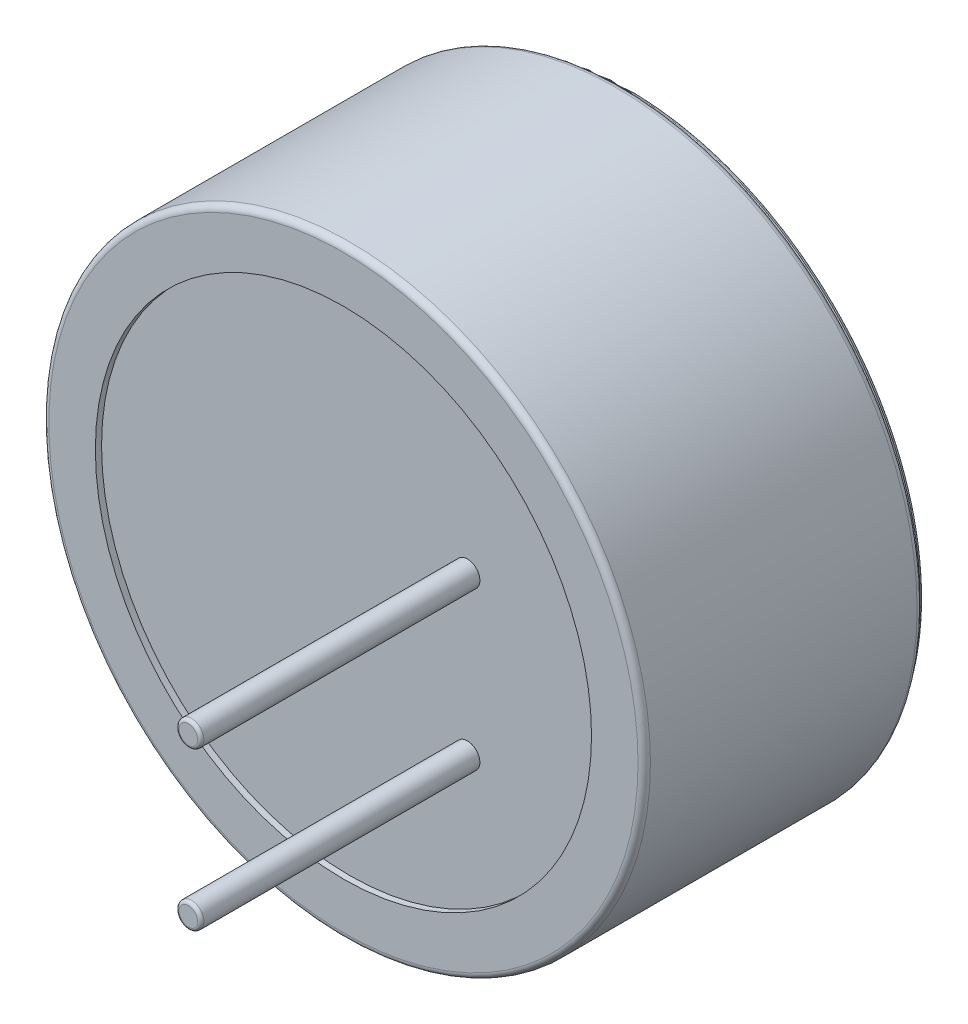
ISO-10303-21;
HEADER;
FILE_DESCRIPTION(('STEP AP214'),'2;1');
FILE_NAME('part.step','',(''),(''),'','','');
FILE_SCHEMA(('AUTOMOTIVE_DESIGN { 1 0 10303 214 1 1 1 1 }'));
ENDSEC;
DATA;
#1=APPLICATION_CONTEXT('core data for automotive mechanical design processes');
#2=APPLICATION_PROTOCOL_DEFINITION('international standard','automotive_design',2000,#1);
#3=PRODUCT_CONTEXT('',#1,'mechanical');
#4=PRODUCT('Part','Part','',(#3));
#5=PRODUCT_RELATED_PRODUCT_CATEGORY('part','',(#4));
#6=PRODUCT_DEFINITION_FORMATION('','',#4);
#7=PRODUCT_DEFINITION_CONTEXT('part definition',#1,'design');
#8=PRODUCT_DEFINITION('design','',#6,#7);
#9=PRODUCT_DEFINITION_SHAPE('','',#8);
#10=(LENGTH_UNIT() NAMED_UNIT(*) SI_UNIT(.MILLI.,.METRE.));
#11=(NAMED_UNIT(*) PLANE_ANGLE_UNIT() SI_UNIT($,.RADIAN.));
#12=(NAMED_UNIT(*) SI_UNIT($,.STERADIAN.) SOLID_ANGLE_UNIT());
#13=UNCERTAINTY_MEASURE_WITH_UNIT(LENGTH_MEASURE(1.E-05),#10,'distance_accuracy_value','');
#14=(GEOMETRIC_REPRESENTATION_CONTEXT(3) GLOBAL_UNCERTAINTY_ASSIGNED_CONTEXT((#13)) GLOBAL_UNIT_ASSIGNED_CONTEXT((#10,
#11,#12)) REPRESENTATION_CONTEXT('',''));
#15=CARTESIAN_POINT('',(0.,0.,0.));
#16=DIRECTION('',(0.,0.,1.));
#17=DIRECTION('',(1.,0.,0.));
#18=AXIS2_PLACEMENT_3D('',#15,#16,#17);
#19=CARTESIAN_POINT('',(0.,0.,-0.1));
#20=DIRECTION('',(0.,0.,1.));
#21=DIRECTION('',(1.,0.,0.));
#22=AXIS2_PLACEMENT_3D('',#19,#20,#21);
#23=CYLINDRICAL_SURFACE('',#22,4.75);
#24=CARTESIAN_POINT('',(0.,0.,-0.05));
#25=DIRECTION('',(0.,0.,-1.));
#26=DIRECTION('',(-1.,0.,0.));
#27=AXIS2_PLACEMENT_3D('',#24,#25,#26);
#28=CIRCLE('',#27,4.75);
#29=CARTESIAN_POINT('',(-4.75,0.,-0.05));
#30=VERTEX_POINT('',#29);
#31=EDGE_CURVE('E11',#30,#30,#28,.F.);
#32=ORIENTED_EDGE('',*,*,#31,.T.);
#33=EDGE_LOOP('',(#32));
#34=FACE_BOUND('',#33,.T.);
#35=CARTESIAN_POINT('',(0.,0.,0.));
#36=DIRECTION('',(0.,0.,-1.));
#37=DIRECTION('',(-1.,0.,0.));
#38=AXIS2_PLACEMENT_3D('',#35,#36,#37);
#39=CIRCLE('',#38,4.75);
#40=CARTESIAN_POINT('',(-4.75,0.,0.));
#41=VERTEX_POINT('',#40);
#42=EDGE_CURVE('E53',#41,#41,#39,.T.);
#43=ORIENTED_EDGE('',*,*,#42,.T.);
#44=EDGE_LOOP('',(#43));
#45=FACE_BOUND('',#44,.T.);
#46=ADVANCED_FACE('F42',(#34,#45),#23,.T.);
#47=CARTESIAN_POINT('',(0.,0.,-0.1));
#48=DIRECTION('',(0.,0.,-1.));
#49=DIRECTION('',(-1.,0.,0.));
#50=AXIS2_PLACEMENT_3D('',#47,#48,#49);
#51=PLANE('',#50);
#52=CARTESIAN_POINT('',(0.,0.,-0.1));
#53=DIRECTION('',(0.,0.,-1.));
#54=DIRECTION('',(-1.,0.,0.));
#55=AXIS2_PLACEMENT_3D('',#52,#53,#54);
#56=CIRCLE('',#55,4.7);
#57=CARTESIAN_POINT('',(-4.7,0.,-0.1));
#58=VERTEX_POINT('',#57);
#59=EDGE_CURVE('E49',#58,#58,#56,.T.);
#60=ORIENTED_EDGE('',*,*,#59,.T.);
#61=EDGE_LOOP('',(#60));
#62=FACE_BOUND('',#61,.T.);
#63=ADVANCED_FACE('F63',(#62),#51,.T.);
#64=CARTESIAN_POINT('',(0.,0.,0.));
#65=DIRECTION('',(0.,0.,-1.));
#66=DIRECTION('',(-1.,0.,0.));
#67=AXIS2_PLACEMENT_3D('',#64,#65,#66);
#68=PLANE('',#67);
#69=ORIENTED_EDGE('',*,*,#42,.F.);
#70=EDGE_LOOP('',(#69));
#71=FACE_BOUND('',#70,.T.);
#72=ADVANCED_FACE('F61',(#71),#68,.F.);
#73=CARTESIAN_POINT('',(0.,0.,-0.05));
#74=DIRECTION('',(0.,0.,-1.));
#75=DIRECTION('',(-1.,0.,0.));
#76=AXIS2_PLACEMENT_3D('',#73,#74,#75);
#77=TOROIDAL_SURFACE('',#76,4.7,0.05);
#78=ORIENTED_EDGE('',*,*,#31,.F.);
#79=EDGE_LOOP('',(#78));
#80=FACE_BOUND('',#79,.T.);
#81=ORIENTED_EDGE('',*,*,#59,.F.);
#82=EDGE_LOOP('',(#81));
#83=FACE_BOUND('',#82,.T.);
#84=ADVANCED_FACE('F44',(#80,#83),#77,.T.);
#85=CLOSED_SHELL('',(#46,#63,#72,#84));
#86=MANIFOLD_SOLID_BREP('B2',#85);
#87=CARTESIAN_POINT('',(2.,1.27,9.));
#88=DIRECTION('',(0.,0.,-1.));
#89=DIRECTION('',(-1.,0.,0.));
#90=AXIS2_PLACEMENT_3D('',#87,#88,#89);
#91=CYLINDRICAL_SURFACE('',#90,0.2);
#92=CARTESIAN_POINT('',(2.,1.27,8.95));
#93=DIRECTION('',(0.,0.,-1.));
#94=DIRECTION('',(-1.,0.,0.));
#95=AXIS2_PLACEMENT_3D('',#92,#93,#94);
#96=CIRCLE('',#95,0.2);
#97=CARTESIAN_POINT('',(1.8,1.27,8.95));
#98=VERTEX_POINT('',#97);
#99=EDGE_CURVE('E41',#98,#98,#96,.T.);
#100=ORIENTED_EDGE('',*,*,#99,.T.);
#101=EDGE_LOOP('',(#100));
#102=FACE_BOUND('',#101,.T.);
#103=CARTESIAN_POINT('',(2.,1.27,4.5));
#104=DIRECTION('',(0.,0.,1.));
#105=DIRECTION('',(-1.,0.,0.));
#106=AXIS2_PLACEMENT_3D('',#103,#104,#105);
#107=CIRCLE('',#106,0.2);
#108=CARTESIAN_POINT('',(1.8,1.27,4.5));
#109=VERTEX_POINT('',#108);
#110=EDGE_CURVE('E117',#109,#109,#107,.T.);
#111=ORIENTED_EDGE('',*,*,#110,.T.);
#112=EDGE_LOOP('',(#111));
#113=FACE_BOUND('',#112,.T.);
#114=ADVANCED_FACE('F106',(#102,#113),#91,.T.);
#115=CARTESIAN_POINT('',(2.,1.27,9.));
#116=DIRECTION('',(0.,0.,-1.));
#117=DIRECTION('',(-1.,0.,0.));
#118=AXIS2_PLACEMENT_3D('',#115,#116,#117);
#119=PLANE('',#118);
#120=CARTESIAN_POINT('',(2.,1.27,9.));
#121=DIRECTION('',(0.,0.,-1.));
#122=DIRECTION('',(-1.,0.,0.));
#123=AXIS2_PLACEMENT_3D('',#120,#121,#122);
#124=CIRCLE('',#123,0.15);
#125=CARTESIAN_POINT('',(1.85,1.27,9.));
#126=VERTEX_POINT('',#125);
#127=EDGE_CURVE('E113',#126,#126,#124,.F.);
#128=ORIENTED_EDGE('',*,*,#127,.T.);
#129=EDGE_LOOP('',(#128));
#130=FACE_BOUND('',#129,.T.);
#131=ADVANCED_FACE('F127',(#130),#119,.F.);
#132=CARTESIAN_POINT('',(2.,1.27,4.5));
#133=DIRECTION('',(0.,0.,-1.));
#134=DIRECTION('',(-1.,0.,0.));
#135=AXIS2_PLACEMENT_3D('',#132,#133,#134);
#136=PLANE('',#135);
#137=ORIENTED_EDGE('',*,*,#110,.F.);
#138=EDGE_LOOP('',(#137));
#139=FACE_BOUND('',#138,.T.);
#140=ADVANCED_FACE('F125',(#139),#136,.T.);
#141=CARTESIAN_POINT('',(2.,1.27,8.95));
#142=DIRECTION('',(0.,0.,-1.));
#143=DIRECTION('',(-1.,0.,0.));
#144=AXIS2_PLACEMENT_3D('',#141,#142,#143);
#145=TOROIDAL_SURFACE('',#144,0.15,0.05);
#146=ORIENTED_EDGE('',*,*,#99,.F.);
#147=EDGE_LOOP('',(#146));
#148=FACE_BOUND('',#147,.T.);
#149=ORIENTED_EDGE('',*,*,#127,.F.);
#150=EDGE_LOOP('',(#149));
#151=FACE_BOUND('',#150,.T.);
#152=ADVANCED_FACE('F108',(#148,#151),#145,.T.);
#153=CLOSED_SHELL('',(#114,#131,#140,#152));
#154=MANIFOLD_SOLID_BREP('B6',#153);
#155=CARTESIAN_POINT('',(2.,-1.27,9.));
#156=DIRECTION('',(0.,0.,-1.));
#157=DIRECTION('',(-1.,0.,0.));
#158=AXIS2_PLACEMENT_3D('',#155,#156,#157);
#159=CYLINDRICAL_SURFACE('',#158,0.2);
#160=CARTESIAN_POINT('',(2.,-1.27,8.95));
#161=DIRECTION('',(0.,0.,1.));
#162=DIRECTION('',(1.,0.,0.));
#163=AXIS2_PLACEMENT_3D('',#160,#161,#162);
#164=CIRCLE('',#163,0.2);
#165=CARTESIAN_POINT('',(2.2,-1.27,8.95));
#166=VERTEX_POINT('',#165);
#167=EDGE_CURVE('E105',#166,#166,#164,.F.);
#168=ORIENTED_EDGE('',*,*,#167,.T.);
#169=EDGE_LOOP('',(#168));
#170=FACE_BOUND('',#169,.T.);
#171=CARTESIAN_POINT('',(2.,-1.27,4.5));
#172=DIRECTION('',(0.,0.,1.));
#173=DIRECTION('',(1.,0.,0.));
#174=AXIS2_PLACEMENT_3D('',#171,#172,#173);
#175=CIRCLE('',#174,0.2);
#176=CARTESIAN_POINT('',(2.2,-1.27,4.5));
#177=VERTEX_POINT('',#176);
#178=EDGE_CURVE('E180',#177,#177,#175,.T.);
#179=ORIENTED_EDGE('',*,*,#178,.T.);
#180=EDGE_LOOP('',(#179));
#181=FACE_BOUND('',#180,.T.);
#182=ADVANCED_FACE('F169',(#170,#181),#159,.T.);
#183=CARTESIAN_POINT('',(2.,-1.27,9.));
#184=DIRECTION('',(0.,0.,1.));
#185=DIRECTION('',(1.,0.,0.));
#186=AXIS2_PLACEMENT_3D('',#183,#184,#185);
#187=PLANE('',#186);
#188=CARTESIAN_POINT('',(2.,-1.27,9.));
#189=DIRECTION('',(0.,0.,1.));
#190=DIRECTION('',(1.,0.,0.));
#191=AXIS2_PLACEMENT_3D('',#188,#189,#190);
#192=CIRCLE('',#191,0.15);
#193=CARTESIAN_POINT('',(2.15,-1.27,9.));
#194=VERTEX_POINT('',#193);
#195=EDGE_CURVE('E176',#194,#194,#192,.T.);
#196=ORIENTED_EDGE('',*,*,#195,.T.);
#197=EDGE_LOOP('',(#196));
#198=FACE_BOUND('',#197,.T.);
#199=ADVANCED_FACE('F190',(#198),#187,.T.);
#200=CARTESIAN_POINT('',(2.,-1.27,4.5));
#201=DIRECTION('',(0.,0.,1.));
#202=DIRECTION('',(1.,0.,0.));
#203=AXIS2_PLACEMENT_3D('',#200,#201,#202);
#204=PLANE('',#203);
#205=ORIENTED_EDGE('',*,*,#178,.F.);
#206=EDGE_LOOP('',(#205));
#207=FACE_BOUND('',#206,.T.);
#208=ADVANCED_FACE('F188',(#207),#204,.F.);
#209=CARTESIAN_POINT('',(2.,-1.27,8.95));
#210=DIRECTION('',(0.,0.,1.));
#211=DIRECTION('',(1.,0.,0.));
#212=AXIS2_PLACEMENT_3D('',#209,#210,#211);
#213=TOROIDAL_SURFACE('',#212,0.15,0.05);
#214=ORIENTED_EDGE('',*,*,#167,.F.);
#215=EDGE_LOOP('',(#214));
#216=FACE_BOUND('',#215,.T.);
#217=ORIENTED_EDGE('',*,*,#195,.F.);
#218=EDGE_LOOP('',(#217));
#219=FACE_BOUND('',#218,.T.);
#220=ADVANCED_FACE('F171',(#216,#219),#213,.T.);
#221=CLOSED_SHELL('',(#182,#199,#208,#220));
#222=MANIFOLD_SOLID_BREP('B36',#221);
#223=CARTESIAN_POINT('',(0.,0.,4.5));
#224=DIRECTION('',(0.,0.,-1.));
#225=DIRECTION('',(-1.,0.,0.));
#226=AXIS2_PLACEMENT_3D('',#223,#224,#225);
#227=CYLINDRICAL_SURFACE('',#226,4.85);
#228=CARTESIAN_POINT('',(0.,0.,4.4));
#229=DIRECTION('',(0.,0.,1.));
#230=DIRECTION('',(1.,0.,0.));
#231=AXIS2_PLACEMENT_3D('',#228,#229,#230);
#232=CIRCLE('',#231,4.85);
#233=CARTESIAN_POINT('',(4.85,0.,4.4));
#234=VERTEX_POINT('',#233);
#235=EDGE_CURVE('E232',#234,#234,#232,.F.);
#236=ORIENTED_EDGE('',*,*,#235,.T.);
#237=EDGE_LOOP('',(#236));
#238=FACE_BOUND('',#237,.T.);
#239=CARTESIAN_POINT('',(0.,0.,0.1));
#240=DIRECTION('',(0.,0.,1.));
#241=DIRECTION('',(1.,0.,0.));
#242=AXIS2_PLACEMENT_3D('',#239,#240,#241);
#243=CIRCLE('',#242,4.85);
#244=CARTESIAN_POINT('',(4.85,0.,0.1));
#245=VERTEX_POINT('',#244);
#246=EDGE_CURVE('E236',#245,#245,#243,.T.);
#247=ORIENTED_EDGE('',*,*,#246,.T.);
#248=EDGE_LOOP('',(#247));
#249=FACE_BOUND('',#248,.T.);
#250=ADVANCED_FACE('F225',(#238,#249),#227,.T.);
#251=CARTESIAN_POINT('',(0.,0.,4.5));
#252=DIRECTION('',(0.,0.,1.));
#253=DIRECTION('',(1.,0.,0.));
#254=AXIS2_PLACEMENT_3D('',#251,#252,#253);
#255=PLANE('',#254);
#256=CARTESIAN_POINT('',(0.,0.,4.5));
#257=DIRECTION('',(0.,0.,1.));
#258=DIRECTION('',(1.,0.,0.));
#259=AXIS2_PLACEMENT_3D('',#256,#257,#258);
#260=CIRCLE('',#259,4.);
#261=CARTESIAN_POINT('',(4.,0.,4.5));
#262=VERTEX_POINT('',#261);
#263=EDGE_CURVE('E246',#262,#262,#260,.T.);
#264=ORIENTED_EDGE('',*,*,#263,.F.);
#265=EDGE_LOOP('',(#264));
#266=FACE_BOUND('',#265,.T.);
#267=CARTESIAN_POINT('',(0.,0.,4.5));
#268=DIRECTION('',(0.,0.,1.));
#269=DIRECTION('',(1.,0.,0.));
#270=AXIS2_PLACEMENT_3D('',#267,#268,#269);
#271=CIRCLE('',#270,4.75);
#272=CARTESIAN_POINT('',(4.75,0.,4.5));
#273=VERTEX_POINT('',#272);
#274=EDGE_CURVE('E240',#273,#273,#271,.T.);
#275=ORIENTED_EDGE('',*,*,#274,.T.);
#276=EDGE_LOOP('',(#275));
#277=FACE_BOUND('',#276,.T.);
#278=ADVANCED_FACE('F260',(#266,#277),#255,.T.);
#279=CARTESIAN_POINT('',(0.,0.,0.));
#280=DIRECTION('',(0.,0.,1.));
#281=DIRECTION('',(1.,0.,0.));
#282=AXIS2_PLACEMENT_3D('',#279,#280,#281);
#283=PLANE('',#282);
#284=CARTESIAN_POINT('',(0.,0.,0.));
#285=DIRECTION('',(0.,0.,1.));
#286=DIRECTION('',(1.,0.,0.));
#287=AXIS2_PLACEMENT_3D('',#284,#285,#286);
#288=CIRCLE('',#287,4.75);
#289=CARTESIAN_POINT('',(4.75,0.,0.));
#290=VERTEX_POINT('',#289);
#291=EDGE_CURVE('E168',#290,#290,#288,.F.);
#292=ORIENTED_EDGE('',*,*,#291,.T.);
#293=EDGE_LOOP('',(#292));
#294=FACE_BOUND('',#293,.T.);
#295=ADVANCED_FACE('F263',(#294),#283,.F.);
#296=CARTESIAN_POINT('',(0.,0.,4.4));
#297=DIRECTION('',(0.,0.,1.));
#298=DIRECTION('',(1.,0.,0.));
#299=AXIS2_PLACEMENT_3D('',#296,#297,#298);
#300=TOROIDAL_SURFACE('',#299,4.75,0.1);
#301=ORIENTED_EDGE('',*,*,#235,.F.);
#302=EDGE_LOOP('',(#301));
#303=FACE_BOUND('',#302,.T.);
#304=ORIENTED_EDGE('',*,*,#274,.F.);
#305=EDGE_LOOP('',(#304));
#306=FACE_BOUND('',#305,.T.);
#307=ADVANCED_FACE('F267',(#303,#306),#300,.T.);
#308=CARTESIAN_POINT('',(0.,0.,0.1));
#309=DIRECTION('',(0.,0.,1.));
#310=DIRECTION('',(1.,0.,0.));
#311=AXIS2_PLACEMENT_3D('',#308,#309,#310);
#312=TOROIDAL_SURFACE('',#311,4.75,0.1);
#313=ORIENTED_EDGE('',*,*,#291,.F.);
#314=EDGE_LOOP('',(#313));
#315=FACE_BOUND('',#314,.T.);
#316=ORIENTED_EDGE('',*,*,#246,.F.);
#317=EDGE_LOOP('',(#316));
#318=FACE_BOUND('',#317,.T.);
#319=ADVANCED_FACE('F227',(#315,#318),#312,.T.);
#320=CARTESIAN_POINT('',(0.,0.,4.4));
#321=DIRECTION('',(0.,0.,1.));
#322=DIRECTION('',(1.,0.,0.));
#323=AXIS2_PLACEMENT_3D('',#320,#321,#322);
#324=CYLINDRICAL_SURFACE('',#323,4.);
#325=CARTESIAN_POINT('',(0.,0.,4.4));
#326=DIRECTION('',(0.,0.,1.));
#327=DIRECTION('',(1.,0.,0.));
#328=AXIS2_PLACEMENT_3D('',#325,#326,#327);
#329=CIRCLE('',#328,4.);
#330=CARTESIAN_POINT('',(4.,0.,4.4));
#331=VERTEX_POINT('',#330);
#332=EDGE_CURVE('E245',#331,#331,#329,.T.);
#333=ORIENTED_EDGE('',*,*,#332,.F.);
#334=EDGE_LOOP('',(#333));
#335=FACE_BOUND('',#334,.T.);
#336=ORIENTED_EDGE('',*,*,#263,.T.);
#337=EDGE_LOOP('',(#336));
#338=FACE_BOUND('',#337,.T.);
#339=ADVANCED_FACE('F254',(#335,#338),#324,.F.);
#340=CARTESIAN_POINT('',(0.,0.,4.4));
#341=DIRECTION('',(0.,0.,1.));
#342=DIRECTION('',(1.,0.,0.));
#343=AXIS2_PLACEMENT_3D('',#340,#341,#342);
#344=PLANE('',#343);
#345=ORIENTED_EDGE('',*,*,#332,.T.);
#346=EDGE_LOOP('',(#345));
#347=FACE_BOUND('',#346,.T.);
#348=ADVANCED_FACE('F252',(#347),#344,.T.);
#349=CLOSED_SHELL('',(#250,#278,#295,#307,#319,#339,#348));
#350=MANIFOLD_SOLID_BREP('B100',#349);
#351=ADVANCED_BREP_SHAPE_REPRESENTATION('',(#18,#86,#154,#222,#350),#14);
#352=SHAPE_DEFINITION_REPRESENTATION(#9,#351);
ENDSEC;
END-ISO-10303-21;
